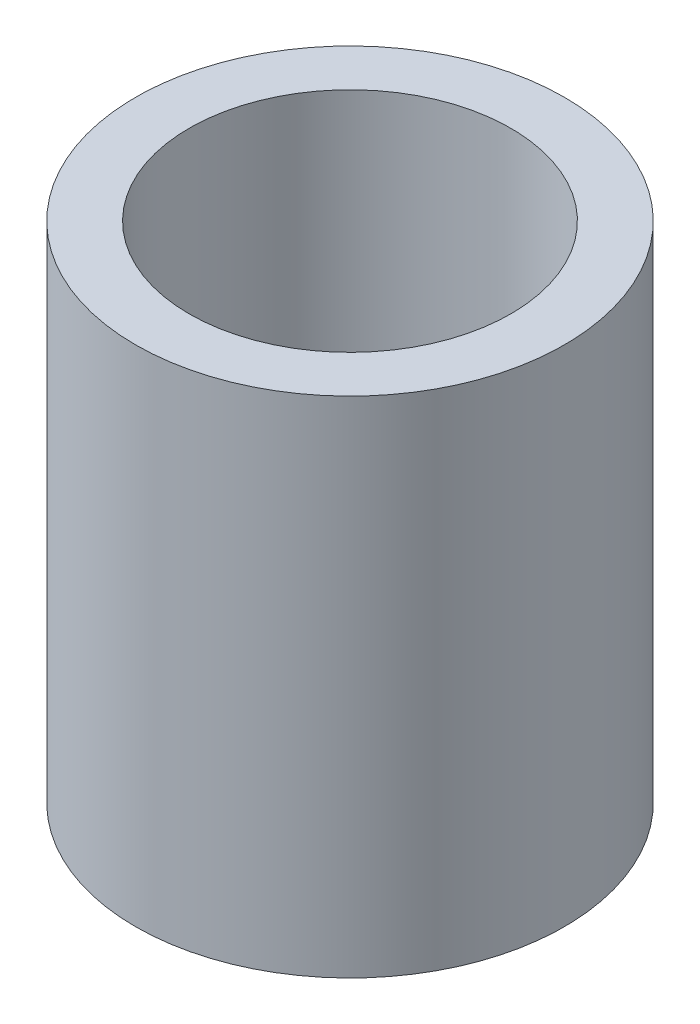
ISO-10303-21;
HEADER;
FILE_DESCRIPTION(('STEP AP214'),'2;1');
FILE_NAME('part.step','',(''),(''),'','','');
FILE_SCHEMA(('AUTOMOTIVE_DESIGN { 1 0 10303 214 1 1 1 1 }'));
ENDSEC;
DATA;
#1=APPLICATION_CONTEXT('core data for automotive mechanical design processes');
#2=APPLICATION_PROTOCOL_DEFINITION('international standard','automotive_design',2000,#1);
#3=PRODUCT_CONTEXT('',#1,'mechanical');
#4=PRODUCT('Part','Part','',(#3));
#5=PRODUCT_RELATED_PRODUCT_CATEGORY('part','',(#4));
#6=PRODUCT_DEFINITION_FORMATION('','',#4);
#7=PRODUCT_DEFINITION_CONTEXT('part definition',#1,'design');
#8=PRODUCT_DEFINITION('design','',#6,#7);
#9=PRODUCT_DEFINITION_SHAPE('','',#8);
#10=(LENGTH_UNIT() NAMED_UNIT(*) SI_UNIT(.MILLI.,.METRE.));
#11=(NAMED_UNIT(*) PLANE_ANGLE_UNIT() SI_UNIT($,.RADIAN.));
#12=(NAMED_UNIT(*) SI_UNIT($,.STERADIAN.) SOLID_ANGLE_UNIT());
#13=UNCERTAINTY_MEASURE_WITH_UNIT(LENGTH_MEASURE(1.E-05),#10,'distance_accuracy_value','');
#14=(GEOMETRIC_REPRESENTATION_CONTEXT(3) GLOBAL_UNCERTAINTY_ASSIGNED_CONTEXT((#13)) GLOBAL_UNIT_ASSIGNED_CONTEXT((#10,
#11,#12)) REPRESENTATION_CONTEXT('',''));
#15=CARTESIAN_POINT('',(0.,0.,0.));
#16=DIRECTION('',(0.,0.,1.));
#17=DIRECTION('',(1.,0.,0.));
#18=AXIS2_PLACEMENT_3D('',#15,#16,#17);
#19=CARTESIAN_POINT('',(0.,4.7,0.));
#20=DIRECTION('',(0.,1.,0.));
#21=DIRECTION('',(0.,0.,1.));
#22=AXIS2_PLACEMENT_3D('',#19,#20,#21);
#23=PLANE('',#22);
#24=CARTESIAN_POINT('',(0.,4.7,0.));
#25=DIRECTION('',(0.,1.,0.));
#26=DIRECTION('',(0.,0.,1.));
#27=AXIS2_PLACEMENT_3D('',#24,#25,#26);
#28=CIRCLE('',#27,2.);
#29=CARTESIAN_POINT('',(0.,4.7,2.));
#30=VERTEX_POINT('',#29);
#31=EDGE_CURVE('E10',#30,#30,#28,.T.);
#32=ORIENTED_EDGE('',*,*,#31,.T.);
#33=EDGE_LOOP('',(#32));
#34=FACE_BOUND('',#33,.T.);
#35=CARTESIAN_POINT('',(0.,4.7,0.));
#36=DIRECTION('',(0.,1.,0.));
#37=DIRECTION('',(0.,0.,1.));
#38=AXIS2_PLACEMENT_3D('',#35,#36,#37);
#39=CIRCLE('',#38,1.5);
#40=CARTESIAN_POINT('',(0.,4.7,1.5));
#41=VERTEX_POINT('',#40);
#42=EDGE_CURVE('E42',#41,#41,#39,.T.);
#43=ORIENTED_EDGE('',*,*,#42,.F.);
#44=EDGE_LOOP('',(#43));
#45=FACE_BOUND('',#44,.T.);
#46=ADVANCED_FACE('F31',(#34,#45),#23,.T.);
#47=CARTESIAN_POINT('',(0.,0.,0.));
#48=DIRECTION('',(0.,1.,0.));
#49=DIRECTION('',(0.,0.,1.));
#50=AXIS2_PLACEMENT_3D('',#47,#48,#49);
#51=PLANE('',#50);
#52=CARTESIAN_POINT('',(0.,0.,0.));
#53=DIRECTION('',(0.,1.,0.));
#54=DIRECTION('',(0.,0.,1.));
#55=AXIS2_PLACEMENT_3D('',#52,#53,#54);
#56=CIRCLE('',#55,2.);
#57=CARTESIAN_POINT('',(0.,0.,2.));
#58=VERTEX_POINT('',#57);
#59=EDGE_CURVE('E35',#58,#58,#56,.T.);
#60=ORIENTED_EDGE('',*,*,#59,.F.);
#61=EDGE_LOOP('',(#60));
#62=FACE_BOUND('',#61,.T.);
#63=CARTESIAN_POINT('',(0.,0.,0.));
#64=DIRECTION('',(0.,1.,0.));
#65=DIRECTION('',(0.,0.,1.));
#66=AXIS2_PLACEMENT_3D('',#63,#64,#65);
#67=CIRCLE('',#66,1.5);
#68=CARTESIAN_POINT('',(0.,0.,1.5));
#69=VERTEX_POINT('',#68);
#70=EDGE_CURVE('E44',#69,#69,#67,.T.);
#71=ORIENTED_EDGE('',*,*,#70,.T.);
#72=EDGE_LOOP('',(#71));
#73=FACE_BOUND('',#72,.T.);
#74=ADVANCED_FACE('F54',(#62,#73),#51,.F.);
#75=CARTESIAN_POINT('',(0.,4.7,0.));
#76=DIRECTION('',(0.,-1.,0.));
#77=DIRECTION('',(0.,0.,-1.));
#78=AXIS2_PLACEMENT_3D('',#75,#76,#77);
#79=CYLINDRICAL_SURFACE('',#78,2.);
#80=ORIENTED_EDGE('',*,*,#31,.F.);
#81=EDGE_LOOP('',(#80));
#82=FACE_BOUND('',#81,.T.);
#83=ORIENTED_EDGE('',*,*,#59,.T.);
#84=EDGE_LOOP('',(#83));
#85=FACE_BOUND('',#84,.T.);
#86=ADVANCED_FACE('F33',(#82,#85),#79,.T.);
#87=CARTESIAN_POINT('',(0.,4.7,0.));
#88=DIRECTION('',(0.,-1.,0.));
#89=DIRECTION('',(0.,0.,-1.));
#90=AXIS2_PLACEMENT_3D('',#87,#88,#89);
#91=CYLINDRICAL_SURFACE('',#90,1.5);
#92=ORIENTED_EDGE('',*,*,#42,.T.);
#93=EDGE_LOOP('',(#92));
#94=FACE_BOUND('',#93,.T.);
#95=ORIENTED_EDGE('',*,*,#70,.F.);
#96=EDGE_LOOP('',(#95));
#97=FACE_BOUND('',#96,.T.);
#98=ADVANCED_FACE('F50',(#94,#97),#91,.F.);
#99=CLOSED_SHELL('',(#46,#74,#86,#98));
#100=MANIFOLD_SOLID_BREP('B2',#99);
#101=ADVANCED_BREP_SHAPE_REPRESENTATION('',(#18,#100),#14);
#102=SHAPE_DEFINITION_REPRESENTATION(#9,#101);
ENDSEC;
END-ISO-10303-21;
